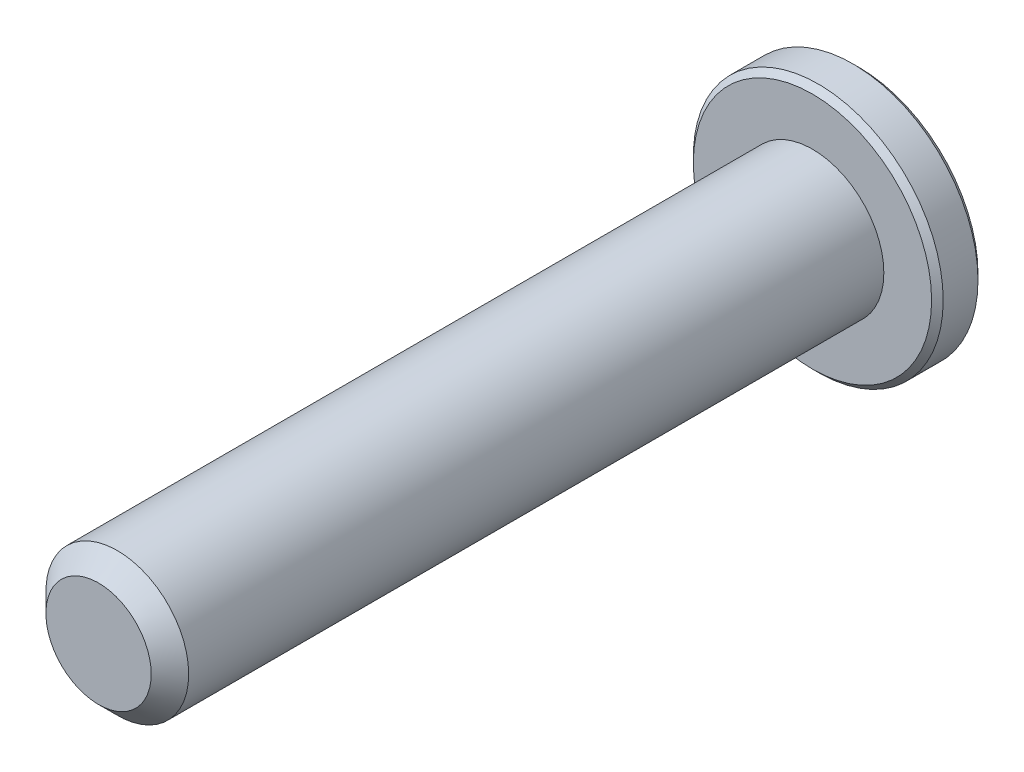
ISO-10303-21;
HEADER;
FILE_DESCRIPTION(('STEP AP214'),'2;1');
FILE_NAME('part.step','',(''),(''),'','','');
FILE_SCHEMA(('AUTOMOTIVE_DESIGN { 1 0 10303 214 1 1 1 1 }'));
ENDSEC;
DATA;
#1=APPLICATION_CONTEXT('core data for automotive mechanical design processes');
#2=APPLICATION_PROTOCOL_DEFINITION('international standard','automotive_design',2000,#1);
#3=PRODUCT_CONTEXT('',#1,'mechanical');
#4=PRODUCT('Part','Part','',(#3));
#5=PRODUCT_RELATED_PRODUCT_CATEGORY('part','',(#4));
#6=PRODUCT_DEFINITION_FORMATION('','',#4);
#7=PRODUCT_DEFINITION_CONTEXT('part definition',#1,'design');
#8=PRODUCT_DEFINITION('design','',#6,#7);
#9=PRODUCT_DEFINITION_SHAPE('','',#8);
#10=(LENGTH_UNIT() NAMED_UNIT(*) SI_UNIT(.MILLI.,.METRE.));
#11=(NAMED_UNIT(*) PLANE_ANGLE_UNIT() SI_UNIT($,.RADIAN.));
#12=(NAMED_UNIT(*) SI_UNIT($,.STERADIAN.) SOLID_ANGLE_UNIT());
#13=UNCERTAINTY_MEASURE_WITH_UNIT(LENGTH_MEASURE(1.E-05),#10,'distance_accuracy_value','');
#14=(GEOMETRIC_REPRESENTATION_CONTEXT(3) GLOBAL_UNCERTAINTY_ASSIGNED_CONTEXT((#13)) GLOBAL_UNIT_ASSIGNED_CONTEXT((#10,
#11,#12)) REPRESENTATION_CONTEXT('',''));
#15=CARTESIAN_POINT('',(0.,0.,0.));
#16=DIRECTION('',(0.,0.,1.));
#17=DIRECTION('',(1.,0.,0.));
#18=AXIS2_PLACEMENT_3D('',#15,#16,#17);
#19=CARTESIAN_POINT('',(0.,0.,-10.65));
#20=DIRECTION('',(0.,0.,1.));
#21=DIRECTION('',(1.,0.,0.));
#22=AXIS2_PLACEMENT_3D('',#19,#20,#21);
#23=PLANE('',#22);
#24=CARTESIAN_POINT('',(0.,0.,-10.65));
#25=DIRECTION('',(0.,0.,1.));
#26=DIRECTION('',(1.,0.,0.));
#27=AXIS2_PLACEMENT_3D('',#24,#25,#26);
#28=CIRCLE('',#27,3.3375);
#29=CARTESIAN_POINT('',(3.3375,0.,-10.65));
#30=VERTEX_POINT('',#29);
#31=EDGE_CURVE('E159',#30,#30,#28,.F.);
#32=ORIENTED_EDGE('',*,*,#31,.T.);
#33=EDGE_LOOP('',(#32));
#34=FACE_BOUND('',#33,.T.);
#35=CARTESIAN_POINT('',(0.,0.,-10.65));
#36=DIRECTION('',(0.,0.,1.));
#37=DIRECTION('',(1.,0.,0.));
#38=AXIS2_PLACEMENT_3D('',#35,#36,#37);
#39=CIRCLE('',#38,1.44337567297406);
#40=CARTESIAN_POINT('',(1.25,0.721687836487035,-10.65));
#41=VERTEX_POINT('',#40);
#42=CARTESIAN_POINT('',(0.,1.44337567297406,-10.65));
#43=VERTEX_POINT('',#42);
#44=EDGE_CURVE('E98',#41,#43,#39,.T.);
#45=ORIENTED_EDGE('',*,*,#44,.T.);
#46=CARTESIAN_POINT('',(0.,0.,-10.65));
#47=DIRECTION('',(0.,0.,1.));
#48=DIRECTION('',(1.,0.,0.));
#49=AXIS2_PLACEMENT_3D('',#46,#47,#48);
#50=CIRCLE('',#49,1.44337567297406);
#51=CARTESIAN_POINT('',(-1.25,0.721687836487029,-10.65));
#52=VERTEX_POINT('',#51);
#53=EDGE_CURVE('E110',#43,#52,#50,.T.);
#54=ORIENTED_EDGE('',*,*,#53,.T.);
#55=CARTESIAN_POINT('',(0.,0.,-10.65));
#56=DIRECTION('',(0.,0.,1.));
#57=DIRECTION('',(1.,0.,0.));
#58=AXIS2_PLACEMENT_3D('',#55,#56,#57);
#59=CIRCLE('',#58,1.44337567297406);
#60=CARTESIAN_POINT('',(-1.25,-0.721687836487029,-10.65));
#61=VERTEX_POINT('',#60);
#62=EDGE_CURVE('E131',#52,#61,#59,.T.);
#63=ORIENTED_EDGE('',*,*,#62,.T.);
#64=CARTESIAN_POINT('',(0.,0.,-10.65));
#65=DIRECTION('',(0.,0.,1.));
#66=DIRECTION('',(1.,0.,0.));
#67=AXIS2_PLACEMENT_3D('',#64,#65,#66);
#68=CIRCLE('',#67,1.44337567297406);
#69=CARTESIAN_POINT('',(0.,-1.44337567297406,-10.65));
#70=VERTEX_POINT('',#69);
#71=EDGE_CURVE('E416',#61,#70,#68,.T.);
#72=ORIENTED_EDGE('',*,*,#71,.T.);
#73=CARTESIAN_POINT('',(0.,0.,-10.65));
#74=DIRECTION('',(0.,0.,1.));
#75=DIRECTION('',(1.,0.,0.));
#76=AXIS2_PLACEMENT_3D('',#73,#74,#75);
#77=CIRCLE('',#76,1.44337567297406);
#78=CARTESIAN_POINT('',(1.25,-0.721687836487034,-10.65));
#79=VERTEX_POINT('',#78);
#80=EDGE_CURVE('E417',#70,#79,#77,.T.);
#81=ORIENTED_EDGE('',*,*,#80,.T.);
#82=CARTESIAN_POINT('',(0.,0.,-10.65));
#83=DIRECTION('',(0.,0.,1.));
#84=DIRECTION('',(1.,0.,0.));
#85=AXIS2_PLACEMENT_3D('',#82,#83,#84);
#86=CIRCLE('',#85,1.44337567297406);
#87=EDGE_CURVE('E113',#79,#41,#86,.T.);
#88=ORIENTED_EDGE('',*,*,#87,.T.);
#89=EDGE_LOOP('',(#45,#54,#63,#72,#81,#88));
#90=FACE_BOUND('',#89,.T.);
#91=ADVANCED_FACE('F39',(#34,#90),#23,.F.);
#92=CARTESIAN_POINT('',(1.25,0.721687836487033,-9.675));
#93=DIRECTION('',(-0.499999999999999,-0.866025403784439,0.));
#94=DIRECTION('',(0.866025403784439,-0.499999999999999,0.));
#95=AXIS2_PLACEMENT_3D('',#92,#93,#94);
#96=PLANE('',#95);
#97=DIRECTION('',(0.,0.,-1.));
#98=VECTOR('',#97,1.);
#99=CARTESIAN_POINT('',(0.,1.44337567297406,-9.675));
#100=LINE('',#99,#98);
#101=CARTESIAN_POINT('',(0.,1.44337567297406,-9.675));
#102=VERTEX_POINT('',#101);
#103=EDGE_CURVE('E127',#102,#43,#100,.T.);
#104=ORIENTED_EDGE('',*,*,#103,.T.);
#105=CARTESIAN_POINT('',(1.2502,0.721572366433196,-10.6501154839091));
#106=CARTESIAN_POINT('',(1.20722483292841,0.746384090710445,-10.6253216680551));
#107=CARTESIAN_POINT('',(1.16353099525405,0.771610739653666,-10.6019837344187));
#108=CARTESIAN_POINT('',(1.07443406915805,0.823050873919156,-10.5592520040845));
#109=CARTESIAN_POINT('',(1.02902250164293,0.849269254648334,-10.5398819923604));
#110=CARTESIAN_POINT('',(0.937452179064737,0.902137405038636,-10.5067004834135));
#111=CARTESIAN_POINT('',(0.891316759824111,0.928773701756388,-10.4928055590527));
#112=CARTESIAN_POINT('',(0.798029919592405,0.982632884076013,-10.4713972821606));
#113=CARTESIAN_POINT('',(0.750881350863618,1.00985412292348,-10.4638679415668));
#114=CARTESIAN_POINT('',(0.669626443112745,1.05676666578643,-10.4570744980507));
#115=CARTESIAN_POINT('',(0.635625123372057,1.07639733689152,-10.4560685591044));
#116=CARTESIAN_POINT('',(0.56768223556752,1.11562418145499,-10.4577614149113));
#117=CARTESIAN_POINT('',(0.53374068234434,1.1352203463451,-10.4604610272155));
#118=CARTESIAN_POINT('',(0.466185143542498,1.1742235548576,-10.4694089303164));
#119=CARTESIAN_POINT('',(0.432571492713223,1.19363040521232,-10.4756605258997));
#120=CARTESIAN_POINT('',(0.365905361782185,1.23212011385119,-10.4913756814139));
#121=CARTESIAN_POINT('',(0.332853128969702,1.2512028293628,-10.5008406200875));
#122=CARTESIAN_POINT('',(0.248200308399734,1.30007715810653,-10.5289313906876));
#123=CARTESIAN_POINT('',(0.19713350757036,1.32956058931202,-10.5496701574522));
#124=CARTESIAN_POINT('',(0.0969991458867438,1.38737318998519,-10.5963871346715));
#125=CARTESIAN_POINT('',(0.0479256884217294,1.41570576386268,-10.6223482959468));
#126=CARTESIAN_POINT('',(-0.000200000000001193,1.4434911430279,-10.6501154839091));
#127=B_SPLINE_CURVE_WITH_KNOTS('',3,(#105,#106,#107,#108,#109,#110,#111,#112,#113,#114,#115,
#116,#117,#118,#119,#120,#121,#122,#123,#124,#125,#126),.UNSPECIFIED.,.F.,.F.,(4,2,2,2,2,2,2,2,
2,2,4),(0.,0.166533409618304,0.334037607289762,0.498880396489697,0.663307919240273,
0.780963963458825,0.898645970148451,1.01643764860773,1.13427993171549,1.32148652032141,
1.50809158792573),.UNSPECIFIED.);
#128=EDGE_CURVE('E95',#41,#43,#127,.T.);
#129=ORIENTED_EDGE('',*,*,#128,.F.);
#130=DIRECTION('',(0.,0.,-1.));
#131=VECTOR('',#130,1.);
#132=CARTESIAN_POINT('',(1.25,0.721687836487033,-9.675));
#133=LINE('',#132,#131);
#134=CARTESIAN_POINT('',(1.25,0.721687836487033,-9.675));
#135=VERTEX_POINT('',#134);
#136=EDGE_CURVE('E394',#135,#41,#133,.T.);
#137=ORIENTED_EDGE('',*,*,#136,.F.);
#138=DIRECTION('',(-0.866025403784439,0.499999999999999,0.));
#139=VECTOR('',#138,1.);
#140=CARTESIAN_POINT('',(1.25,0.721687836487033,-9.675));
#141=LINE('',#140,#139);
#142=EDGE_CURVE('E122',#135,#102,#141,.T.);
#143=ORIENTED_EDGE('',*,*,#142,.T.);
#144=EDGE_LOOP('',(#104,#129,#137,#143));
#145=FACE_BOUND('',#144,.T.);
#146=ADVANCED_FACE('F134',(#145),#96,.T.);
#147=CARTESIAN_POINT('',(1.25,-0.721687836487029,-9.675));
#148=DIRECTION('',(-1.,0.,0.));
#149=DIRECTION('',(0.,-1.,0.));
#150=AXIS2_PLACEMENT_3D('',#147,#148,#149);
#151=PLANE('',#150);
#152=ORIENTED_EDGE('',*,*,#136,.T.);
#153=CARTESIAN_POINT('',(1.25,-1.38992943348888,-11.0759567827648));
#154=CARTESIAN_POINT('',(1.25,-1.35585360144598,-11.0506238459055));
#155=CARTESIAN_POINT('',(1.25,-1.32158265708561,-11.0255540386235));
#156=CARTESIAN_POINT('',(1.25,-1.25257320054391,-10.9760477721055));
#157=CARTESIAN_POINT('',(1.25,-1.21783456799035,-10.9516114808468));
#158=CARTESIAN_POINT('',(1.25,-1.11229379200971,-10.8790661726139));
#159=CARTESIAN_POINT('',(1.25,-1.04068485708168,-10.8321110392595));
#160=CARTESIAN_POINT('',(1.25,-0.890834011639571,-10.7403708166644));
#161=CARTESIAN_POINT('',(1.25,-0.812441254075324,-10.6958291712301));
#162=CARTESIAN_POINT('',(1.25,-0.651805951733885,-10.6146629588727));
#163=CARTESIAN_POINT('',(1.25,-0.56957751460335,-10.578011794068));
#164=CARTESIAN_POINT('',(1.25,-0.445666902783946,-10.5331887847256));
#165=CARTESIAN_POINT('',(1.25,-0.405715906756982,-10.5202456431435));
#166=CARTESIAN_POINT('',(1.25,-0.324892689132276,-10.4975737854096));
#167=CARTESIAN_POINT('',(1.25,-0.284020400151317,-10.4878453051979));
#168=CARTESIAN_POINT('',(1.25,-0.202258662465061,-10.4722576398138));
#169=CARTESIAN_POINT('',(1.25,-0.161381483064384,-10.4663350734316));
#170=CARTESIAN_POINT('',(1.25,-0.0792441307238307,-10.4584670213259));
#171=CARTESIAN_POINT('',(1.25,-0.0379840154943755,-10.4565209457961));
#172=CARTESIAN_POINT('',(1.25,0.0432341600364644,-10.456732896492));
#173=CARTESIAN_POINT('',(1.25,0.0831926097530761,-10.458764549044));
#174=CARTESIAN_POINT('',(1.25,0.16274644611995,-10.4665521810558));
#175=CARTESIAN_POINT('',(1.25,0.202341758544678,-10.4723089054431));
#176=CARTESIAN_POINT('',(1.25,0.281546319129819,-10.487338614174));
#177=CARTESIAN_POINT('',(1.25,0.321144394728611,-10.4966696274947));
#178=CARTESIAN_POINT('',(1.25,0.399480919290785,-10.5183670352383));
#179=CARTESIAN_POINT('',(1.25,0.438219456017127,-10.5307331181967));
#180=CARTESIAN_POINT('',(1.25,0.562551887219004,-10.5750110832811));
#181=CARTESIAN_POINT('',(1.25,0.646311872820087,-10.6120618108018));
#182=CARTESIAN_POINT('',(1.25,0.809873231963305,-10.6943641458391));
#183=CARTESIAN_POINT('',(1.25,0.889658742138619,-10.739645710239));
#184=CARTESIAN_POINT('',(1.25,1.04210036236046,-10.8329829301041));
#185=CARTESIAN_POINT('',(1.25,1.11491334005908,-10.8807855019631));
#186=CARTESIAN_POINT('',(1.25,1.22219009712169,-10.9546486700497));
#187=CARTESIAN_POINT('',(1.25,1.25748474843868,-10.9795235003093));
#188=CARTESIAN_POINT('',(1.25,1.32759376690004,-11.0299218847159));
#189=CARTESIAN_POINT('',(1.25,1.36240826213734,-11.0554452604736));
#190=CARTESIAN_POINT('',(1.25,1.3970231565127,-11.0812372736986));
#191=B_SPLINE_CURVE_WITH_KNOTS('',3,(#153,#154,#155,#156,#157,#158,#159,#160,#161,#162,#163,
#164,#165,#166,#167,#168,#169,#170,#171,#172,#173,#174,#175,#176,#177,#178,#179,#180,#181,#182,
#183,#184,#185,#186,#187,#188,#189,#190),.UNSPECIFIED.,.F.,.F.,(4,2,2,2,2,2,2,2,2,2,2,2,2,2,2,2,
2,2,4),(0.,0.127379033817001,0.254791503830237,0.511561140405461,0.781814668857773,
1.05114242314894,1.17702064742504,1.30290810848098,1.42664072359053,1.55035498493451,
1.67020252454504,1.7900740382739,1.91198034452075,2.03387414574236,2.30782771694623,
2.58279909340041,2.84397769429347,2.97351138093345,3.10300981562538),.UNSPECIFIED.);
#192=EDGE_CURVE('E103',#79,#41,#191,.T.);
#193=ORIENTED_EDGE('',*,*,#192,.F.);
#194=DIRECTION('',(0.,0.,-1.));
#195=VECTOR('',#194,1.);
#196=CARTESIAN_POINT('',(1.25,-0.721687836487029,-9.675));
#197=LINE('',#196,#195);
#198=CARTESIAN_POINT('',(1.25,-0.721687836487029,-9.675));
#199=VERTEX_POINT('',#198);
#200=EDGE_CURVE('E397',#199,#79,#197,.T.);
#201=ORIENTED_EDGE('',*,*,#200,.F.);
#202=DIRECTION('',(0.,1.,0.));
#203=VECTOR('',#202,1.);
#204=CARTESIAN_POINT('',(1.25,-0.721687836487029,-9.675));
#205=LINE('',#204,#203);
#206=EDGE_CURVE('E55',#199,#135,#205,.T.);
#207=ORIENTED_EDGE('',*,*,#206,.T.);
#208=EDGE_LOOP('',(#152,#193,#201,#207));
#209=FACE_BOUND('',#208,.T.);
#210=ADVANCED_FACE('F183',(#209),#151,.T.);
#211=CARTESIAN_POINT('',(0.,-1.44337567297406,-9.675));
#212=DIRECTION('',(-0.5,0.866025403784438,0.));
#213=DIRECTION('',(-0.866025403784439,-0.5,0.));
#214=AXIS2_PLACEMENT_3D('',#211,#212,#213);
#215=PLANE('',#214);
#216=ORIENTED_EDGE('',*,*,#200,.T.);
#217=CARTESIAN_POINT('',(-0.000199999999999487,-1.4434911430279,-10.6501154839091));
#218=CARTESIAN_POINT('',(0.0427751670715872,-1.41867941875065,-10.6253216680551));
#219=CARTESIAN_POINT('',(0.0864690047459486,-1.39345276980743,-10.6019837344187));
#220=CARTESIAN_POINT('',(0.175565930841943,-1.34201263554194,-10.5592520040845));
#221=CARTESIAN_POINT('',(0.220977498357065,-1.31579425481276,-10.5398819923604));
#222=CARTESIAN_POINT('',(0.312547820935261,-1.26292610442246,-10.5067004834135));
#223=CARTESIAN_POINT('',(0.358683240175886,-1.23628980770471,-10.4928055590527));
#224=CARTESIAN_POINT('',(0.451970080407593,-1.18243062538508,-10.4713972821606));
#225=CARTESIAN_POINT('',(0.49911864913638,-1.15520938653761,-10.4638679415668));
#226=CARTESIAN_POINT('',(0.580373556887253,-1.10829684367466,-10.4570744980507));
#227=CARTESIAN_POINT('',(0.614374876627941,-1.08866617256958,-10.4560685591043));
#228=CARTESIAN_POINT('',(0.682317764432478,-1.04943932800611,-10.4577614149113));
#229=CARTESIAN_POINT('',(0.716259317655657,-1.02984316311599,-10.4604610272155));
#230=CARTESIAN_POINT('',(0.783814856457499,-0.990839954603495,-10.4694089303164));
#231=CARTESIAN_POINT('',(0.817428507286775,-0.971433104248767,-10.4756605258997));
#232=CARTESIAN_POINT('',(0.884094638217813,-0.932943395609901,-10.4913756814139));
#233=CARTESIAN_POINT('',(0.917146871030295,-0.913860680098296,-10.5008406200875));
#234=CARTESIAN_POINT('',(1.00179969160026,-0.864986351354564,-10.5289313906876));
#235=CARTESIAN_POINT('',(1.05286649242964,-0.835502920149072,-10.5496701574522));
#236=CARTESIAN_POINT('',(1.15300085411325,-0.777690319475905,-10.5963871346715));
#237=CARTESIAN_POINT('',(1.20207431157827,-0.749357745598413,-10.6223482959468));
#238=CARTESIAN_POINT('',(1.2502,-0.721572366433191,-10.6501154839091));
#239=B_SPLINE_CURVE_WITH_KNOTS('',3,(#217,#218,#219,#220,#221,#222,#223,#224,#225,#226,#227,
#228,#229,#230,#231,#232,#233,#234,#235,#236,#237,#238),.UNSPECIFIED.,.F.,.F.,(4,2,2,2,2,2,2,2,
2,2,4),(0.,0.166533409618304,0.334037607289762,0.498880396489698,0.663307919240274,
0.780963963458826,0.898645970148452,1.01643764860773,1.13427993171549,1.32148652032141,
1.50809158792573),.UNSPECIFIED.);
#240=EDGE_CURVE('E425',#70,#79,#239,.T.);
#241=ORIENTED_EDGE('',*,*,#240,.F.);
#242=DIRECTION('',(0.,0.,-1.));
#243=VECTOR('',#242,1.);
#244=CARTESIAN_POINT('',(0.,-1.44337567297406,-9.675));
#245=LINE('',#244,#243);
#246=CARTESIAN_POINT('',(0.,-1.44337567297406,-9.675));
#247=VERTEX_POINT('',#246);
#248=EDGE_CURVE('E400',#247,#70,#245,.T.);
#249=ORIENTED_EDGE('',*,*,#248,.F.);
#250=DIRECTION('',(0.866025403784438,0.5,0.));
#251=VECTOR('',#250,1.);
#252=CARTESIAN_POINT('',(0.,-1.44337567297406,-9.675));
#253=LINE('',#252,#251);
#254=EDGE_CURVE('E63',#247,#199,#253,.T.);
#255=ORIENTED_EDGE('',*,*,#254,.T.);
#256=EDGE_LOOP('',(#216,#241,#249,#255));
#257=FACE_BOUND('',#256,.T.);
#258=ADVANCED_FACE('F301',(#257),#215,.T.);
#259=CARTESIAN_POINT('',(-1.25,-0.721687836487029,-9.675));
#260=DIRECTION('',(0.499999999999999,0.866025403784439,0.));
#261=DIRECTION('',(-0.866025403784439,0.499999999999999,0.));
#262=AXIS2_PLACEMENT_3D('',#259,#260,#261);
#263=PLANE('',#262);
#264=ORIENTED_EDGE('',*,*,#248,.T.);
#265=CARTESIAN_POINT('',(-1.2502,-0.721572366433191,-10.6501154839091));
#266=CARTESIAN_POINT('',(-1.20722483292841,-0.746384090710441,-10.6253216680551));
#267=CARTESIAN_POINT('',(-1.16353099525405,-0.771610739653661,-10.6019837344187));
#268=CARTESIAN_POINT('',(-1.07443406915806,-0.823050873919152,-10.5592520040845));
#269=CARTESIAN_POINT('',(-1.02902250164294,-0.84926925464833,-10.5398819923604));
#270=CARTESIAN_POINT('',(-0.93745217906474,-0.902137405038632,-10.5067004834135));
#271=CARTESIAN_POINT('',(-0.891316759824114,-0.928773701756384,-10.4928055590527));
#272=CARTESIAN_POINT('',(-0.798029919592407,-0.982632884076009,-10.4713972821606));
#273=CARTESIAN_POINT('',(-0.75088135086362,-1.00985412292348,-10.4638679415668));
#274=CARTESIAN_POINT('',(-0.669626443112748,-1.05676666578642,-10.4570744980507));
#275=CARTESIAN_POINT('',(-0.635625123372059,-1.07639733689151,-10.4560685591043));
#276=CARTESIAN_POINT('',(-0.567682235567523,-1.11562418145498,-10.4577614149113));
#277=CARTESIAN_POINT('',(-0.533740682344343,-1.1352203463451,-10.4604610272155));
#278=CARTESIAN_POINT('',(-0.466185143542501,-1.17422355485759,-10.4694089303164));
#279=CARTESIAN_POINT('',(-0.432571492713225,-1.19363040521232,-10.4756605258997));
#280=CARTESIAN_POINT('',(-0.365905361782187,-1.23212011385119,-10.4913756814139));
#281=CARTESIAN_POINT('',(-0.332853128969705,-1.25120282936279,-10.5008406200875));
#282=CARTESIAN_POINT('',(-0.248200308399736,-1.30007715810652,-10.5289313906876));
#283=CARTESIAN_POINT('',(-0.197133507570362,-1.32956058931202,-10.5496701574522));
#284=CARTESIAN_POINT('',(-0.0969991458867449,-1.38737318998518,-10.5963871346715));
#285=CARTESIAN_POINT('',(-0.0479256884217299,-1.41570576386268,-10.6223482959468));
#286=CARTESIAN_POINT('',(0.000200000000000766,-1.4434911430279,-10.6501154839091));
#287=B_SPLINE_CURVE_WITH_KNOTS('',3,(#265,#266,#267,#268,#269,#270,#271,#272,#273,#274,#275,
#276,#277,#278,#279,#280,#281,#282,#283,#284,#285,#286),.UNSPECIFIED.,.F.,.F.,(4,2,2,2,2,2,2,2,
2,2,4),(0.,0.166533409618304,0.334037607289762,0.498880396489698,0.663307919240274,
0.780963963458826,0.898645970148452,1.01643764860773,1.13427993171549,1.32148652032141,
1.50809158792574),.UNSPECIFIED.);
#288=EDGE_CURVE('E413',#61,#70,#287,.T.);
#289=ORIENTED_EDGE('',*,*,#288,.F.);
#290=DIRECTION('',(0.,0.,-1.));
#291=VECTOR('',#290,1.);
#292=CARTESIAN_POINT('',(-1.25,-0.721687836487029,-9.675));
#293=LINE('',#292,#291);
#294=CARTESIAN_POINT('',(-1.25,-0.721687836487029,-9.675));
#295=VERTEX_POINT('',#294);
#296=EDGE_CURVE('E144',#295,#61,#293,.T.);
#297=ORIENTED_EDGE('',*,*,#296,.F.);
#298=DIRECTION('',(0.866025403784439,-0.499999999999999,0.));
#299=VECTOR('',#298,1.);
#300=CARTESIAN_POINT('',(-1.25,-0.721687836487029,-9.675));
#301=LINE('',#300,#299);
#302=EDGE_CURVE('E387',#295,#247,#301,.T.);
#303=ORIENTED_EDGE('',*,*,#302,.T.);
#304=EDGE_LOOP('',(#264,#289,#297,#303));
#305=FACE_BOUND('',#304,.T.);
#306=ADVANCED_FACE('F309',(#305),#263,.T.);
#307=CARTESIAN_POINT('',(-1.25,0.721687836487031,-9.675));
#308=DIRECTION('',(1.,0.,0.));
#309=DIRECTION('',(0.,0.,-1.));
#310=AXIS2_PLACEMENT_3D('',#307,#308,#309);
#311=PLANE('',#310);
#312=ORIENTED_EDGE('',*,*,#296,.T.);
#313=CARTESIAN_POINT('',(-1.25,-1.38992943348888,-11.0759567827648));
#314=CARTESIAN_POINT('',(-1.25,-1.35585360144598,-11.0506238459055));
#315=CARTESIAN_POINT('',(-1.25,-1.32158265708561,-11.0255540386235));
#316=CARTESIAN_POINT('',(-1.25,-1.25257320054391,-10.9760477721055));
#317=CARTESIAN_POINT('',(-1.25,-1.21783456799035,-10.9516114808468));
#318=CARTESIAN_POINT('',(-1.25,-1.11229379200971,-10.8790661726139));
#319=CARTESIAN_POINT('',(-1.25,-1.04068485708168,-10.8321110392595));
#320=CARTESIAN_POINT('',(-1.25,-0.890834011639572,-10.7403708166644));
#321=CARTESIAN_POINT('',(-1.25,-0.812441254075325,-10.6958291712301));
#322=CARTESIAN_POINT('',(-1.25,-0.651805951733886,-10.6146629588727));
#323=CARTESIAN_POINT('',(-1.25,-0.56957751460335,-10.578011794068));
#324=CARTESIAN_POINT('',(-1.25,-0.445666902783946,-10.5331887847256));
#325=CARTESIAN_POINT('',(-1.25,-0.405715906756982,-10.5202456431435));
#326=CARTESIAN_POINT('',(-1.25,-0.324892689132276,-10.4975737854096));
#327=CARTESIAN_POINT('',(-1.25,-0.284020400151317,-10.4878453051979));
#328=CARTESIAN_POINT('',(-1.25,-0.20225866246506,-10.4722576398138));
#329=CARTESIAN_POINT('',(-1.25,-0.161381483064383,-10.4663350734316));
#330=CARTESIAN_POINT('',(-1.25,-0.0792441307238298,-10.4584670213259));
#331=CARTESIAN_POINT('',(-1.25,-0.0379840154943746,-10.4565209457961));
#332=CARTESIAN_POINT('',(-1.25,0.0432341600364653,-10.456732896492));
#333=CARTESIAN_POINT('',(-1.25,0.083192609753077,-10.458764549044));
#334=CARTESIAN_POINT('',(-1.25,0.16274644611995,-10.4665521810558));
#335=CARTESIAN_POINT('',(-1.25,0.202341758544679,-10.4723089054431));
#336=CARTESIAN_POINT('',(-1.25,0.28154631912982,-10.487338614174));
#337=CARTESIAN_POINT('',(-1.25,0.321144394728612,-10.4966696274947));
#338=CARTESIAN_POINT('',(-1.25,0.399480919290787,-10.5183670352383));
#339=CARTESIAN_POINT('',(-1.25,0.438219456017129,-10.5307331181967));
#340=CARTESIAN_POINT('',(-1.25,0.562551887219006,-10.5750110832811));
#341=CARTESIAN_POINT('',(-1.25,0.646311872820089,-10.6120618108018));
#342=CARTESIAN_POINT('',(-1.25,0.809873231963309,-10.6943641458391));
#343=CARTESIAN_POINT('',(-1.25,0.889658742138624,-10.739645710239));
#344=CARTESIAN_POINT('',(-1.25,1.04210036236046,-10.8329829301041));
#345=CARTESIAN_POINT('',(-1.25,1.11491334005909,-10.8807855019631));
#346=CARTESIAN_POINT('',(-1.25,1.22219009712169,-10.9546486700497));
#347=CARTESIAN_POINT('',(-1.25,1.25748474843869,-10.9795235003094));
#348=CARTESIAN_POINT('',(-1.25,1.32759376690005,-11.0299218847159));
#349=CARTESIAN_POINT('',(-1.25,1.36240826213735,-11.0554452604736));
#350=CARTESIAN_POINT('',(-1.25,1.39702315651271,-11.0812372736986));
#351=B_SPLINE_CURVE_WITH_KNOTS('',3,(#313,#314,#315,#316,#317,#318,#319,#320,#321,#322,#323,
#324,#325,#326,#327,#328,#329,#330,#331,#332,#333,#334,#335,#336,#337,#338,#339,#340,#341,#342,
#343,#344,#345,#346,#347,#348,#349,#350),.UNSPECIFIED.,.F.,.F.,(4,2,2,2,2,2,2,2,2,2,2,2,2,2,2,2,
2,2,4),(0.,0.127379033817002,0.254791503830238,0.511561140405459,0.781814668857771,
1.05114242314894,1.17702064742503,1.30290810848098,1.42664072359054,1.55035498493452,
1.67020252454504,1.7900740382739,1.91198034452075,2.03387414574236,2.30782771694623,
2.58279909340042,2.84397769429347,2.97351138093346,3.10300981562539),.UNSPECIFIED.);
#352=EDGE_CURVE('E408',#52,#61,#351,.F.);
#353=ORIENTED_EDGE('',*,*,#352,.F.);
#354=DIRECTION('',(0.,0.,-1.));
#355=VECTOR('',#354,1.);
#356=CARTESIAN_POINT('',(-1.25,0.721687836487031,-9.675));
#357=LINE('',#356,#355);
#358=CARTESIAN_POINT('',(-1.25,0.721687836487031,-9.675));
#359=VERTEX_POINT('',#358);
#360=EDGE_CURVE('E129',#359,#52,#357,.T.);
#361=ORIENTED_EDGE('',*,*,#360,.F.);
#362=DIRECTION('',(0.,-1.,0.));
#363=VECTOR('',#362,1.);
#364=CARTESIAN_POINT('',(-1.25,0.721687836487031,-9.675));
#365=LINE('',#364,#363);
#366=EDGE_CURVE('E384',#359,#295,#365,.T.);
#367=ORIENTED_EDGE('',*,*,#366,.T.);
#368=EDGE_LOOP('',(#312,#353,#361,#367));
#369=FACE_BOUND('',#368,.T.);
#370=ADVANCED_FACE('F317',(#369),#311,.T.);
#371=CARTESIAN_POINT('',(0.,1.44337567297406,-9.675));
#372=DIRECTION('',(0.5,-0.866025403784438,0.));
#373=DIRECTION('',(0.866025403784439,0.5,0.));
#374=AXIS2_PLACEMENT_3D('',#371,#372,#373);
#375=PLANE('',#374);
#376=ORIENTED_EDGE('',*,*,#360,.T.);
#377=CARTESIAN_POINT('',(0.000199999999997979,1.4434911430279,-10.6501154839091));
#378=CARTESIAN_POINT('',(-0.0427751670715884,1.41867941875065,-10.6253216680551));
#379=CARTESIAN_POINT('',(-0.0864690047459495,1.39345276980743,-10.6019837344187));
#380=CARTESIAN_POINT('',(-0.175565930841943,1.34201263554194,-10.5592520040845));
#381=CARTESIAN_POINT('',(-0.220977498357065,1.31579425481276,-10.5398819923604));
#382=CARTESIAN_POINT('',(-0.312547820935261,1.26292610442246,-10.5067004834135));
#383=CARTESIAN_POINT('',(-0.358683240175886,1.23628980770471,-10.4928055590527));
#384=CARTESIAN_POINT('',(-0.451970080407593,1.18243062538508,-10.4713972821606));
#385=CARTESIAN_POINT('',(-0.49911864913638,1.15520938653761,-10.4638679415668));
#386=CARTESIAN_POINT('',(-0.580373556887252,1.10829684367467,-10.4570744980507));
#387=CARTESIAN_POINT('',(-0.61437487662794,1.08866617256958,-10.4560685591044));
#388=CARTESIAN_POINT('',(-0.682317764432477,1.04943932800611,-10.4577614149113));
#389=CARTESIAN_POINT('',(-0.716259317655657,1.02984316311599,-10.4604610272155));
#390=CARTESIAN_POINT('',(-0.783814856457499,0.990839954603499,-10.4694089303164));
#391=CARTESIAN_POINT('',(-0.817428507286774,0.971433104248771,-10.4756605258997));
#392=CARTESIAN_POINT('',(-0.884094638217812,0.932943395609905,-10.4913756814139));
#393=CARTESIAN_POINT('',(-0.917146871030295,0.9138606800983,-10.5008406200875));
#394=CARTESIAN_POINT('',(-1.00179969160026,0.864986351354567,-10.5289313906876));
#395=CARTESIAN_POINT('',(-1.05286649242964,0.835502920149075,-10.5496701574522));
#396=CARTESIAN_POINT('',(-1.15300085411325,0.777690319475908,-10.5963871346715));
#397=CARTESIAN_POINT('',(-1.20207431157827,0.749357745598416,-10.6223482959468));
#398=CARTESIAN_POINT('',(-1.2502,0.721572366433194,-10.6501154839091));
#399=B_SPLINE_CURVE_WITH_KNOTS('',3,(#377,#378,#379,#380,#381,#382,#383,#384,#385,#386,#387,
#388,#389,#390,#391,#392,#393,#394,#395,#396,#397,#398),.UNSPECIFIED.,.F.,.F.,(4,2,2,2,2,2,2,2,
2,2,4),(0.,0.166533409618302,0.33403760728976,0.498880396489696,0.663307919240271,
0.780963963458823,0.898645970148449,1.01643764860773,1.13427993171549,1.3214865203214,
1.50809158792573),.UNSPECIFIED.);
#400=EDGE_CURVE('E120',#43,#52,#399,.T.);
#401=ORIENTED_EDGE('',*,*,#400,.F.);
#402=ORIENTED_EDGE('',*,*,#103,.F.);
#403=DIRECTION('',(-0.866025403784439,-0.5,0.));
#404=VECTOR('',#403,1.);
#405=CARTESIAN_POINT('',(0.,1.44337567297406,-9.675));
#406=LINE('',#405,#404);
#407=EDGE_CURVE('E381',#102,#359,#406,.T.);
#408=ORIENTED_EDGE('',*,*,#407,.T.);
#409=EDGE_LOOP('',(#376,#401,#402,#408));
#410=FACE_BOUND('',#409,.T.);
#411=ADVANCED_FACE('F126',(#410),#375,.T.);
#412=CARTESIAN_POINT('',(0.,0.,10.65));
#413=DIRECTION('',(0.,0.,-1.));
#414=DIRECTION('',(-1.,0.,0.));
#415=AXIS2_PLACEMENT_3D('',#412,#413,#414);
#416=CYLINDRICAL_SURFACE('',#415,2.);
#417=CARTESIAN_POINT('',(0.,0.,10.125));
#418=DIRECTION('',(0.,0.,1.));
#419=DIRECTION('',(1.,0.,0.));
#420=AXIS2_PLACEMENT_3D('',#417,#418,#419);
#421=CIRCLE('',#420,2.);
#422=CARTESIAN_POINT('',(2.,0.,10.125));
#423=VERTEX_POINT('',#422);
#424=EDGE_CURVE('E11',#423,#423,#421,.F.);
#425=ORIENTED_EDGE('',*,*,#424,.T.);
#426=EDGE_LOOP('',(#425));
#427=FACE_BOUND('',#426,.T.);
#428=CARTESIAN_POINT('',(0.,0.,-9.35));
#429=DIRECTION('',(0.,0.,1.));
#430=DIRECTION('',(1.,0.,0.));
#431=AXIS2_PLACEMENT_3D('',#428,#429,#430);
#432=CIRCLE('',#431,2.);
#433=CARTESIAN_POINT('',(2.,0.,-9.35));
#434=VERTEX_POINT('',#433);
#435=EDGE_CURVE('E137',#434,#434,#432,.T.);
#436=ORIENTED_EDGE('',*,*,#435,.T.);
#437=EDGE_LOOP('',(#436));
#438=FACE_BOUND('',#437,.T.);
#439=ADVANCED_FACE('F195',(#427,#438),#416,.T.);
#440=CARTESIAN_POINT('',(0.,0.,10.65));
#441=DIRECTION('',(0.,0.,1.));
#442=DIRECTION('',(1.,0.,0.));
#443=AXIS2_PLACEMENT_3D('',#440,#441,#442);
#444=PLANE('',#443);
#445=CARTESIAN_POINT('',(0.,0.,10.65));
#446=DIRECTION('',(0.,0.,1.));
#447=DIRECTION('',(1.,0.,0.));
#448=AXIS2_PLACEMENT_3D('',#445,#446,#447);
#449=CIRCLE('',#448,1.475);
#450=CARTESIAN_POINT('',(1.475,0.,10.65));
#451=VERTEX_POINT('',#450);
#452=EDGE_CURVE('E48',#451,#451,#449,.T.);
#453=ORIENTED_EDGE('',*,*,#452,.T.);
#454=EDGE_LOOP('',(#453));
#455=FACE_BOUND('',#454,.T.);
#456=ADVANCED_FACE('F166',(#455),#444,.T.);
#457=CARTESIAN_POINT('',(0.,0.,-9.35));
#458=DIRECTION('',(0.,0.,1.));
#459=DIRECTION('',(1.,0.,0.));
#460=AXIS2_PLACEMENT_3D('',#457,#458,#459);
#461=PLANE('',#460);
#462=CARTESIAN_POINT('',(0.,0.,-9.35));
#463=DIRECTION('',(0.,0.,1.));
#464=DIRECTION('',(1.,0.,0.));
#465=AXIS2_PLACEMENT_3D('',#462,#463,#464);
#466=CIRCLE('',#465,3.3375);
#467=CARTESIAN_POINT('',(3.3375,0.,-9.35));
#468=VERTEX_POINT('',#467);
#469=EDGE_CURVE('E142',#468,#468,#466,.T.);
#470=ORIENTED_EDGE('',*,*,#469,.T.);
#471=EDGE_LOOP('',(#470));
#472=FACE_BOUND('',#471,.T.);
#473=ORIENTED_EDGE('',*,*,#435,.F.);
#474=EDGE_LOOP('',(#473));
#475=FACE_BOUND('',#474,.T.);
#476=ADVANCED_FACE('F187',(#472,#475),#461,.T.);
#477=CARTESIAN_POINT('',(0.,0.,-9.35));
#478=DIRECTION('',(0.,0.,-1.));
#479=DIRECTION('',(-1.,0.,0.));
#480=AXIS2_PLACEMENT_3D('',#477,#478,#479);
#481=CYLINDRICAL_SURFACE('',#480,3.5);
#482=CARTESIAN_POINT('',(0.,0.,-9.5125));
#483=DIRECTION('',(0.,0.,1.));
#484=DIRECTION('',(1.,0.,0.));
#485=AXIS2_PLACEMENT_3D('',#482,#483,#484);
#486=CIRCLE('',#485,3.5);
#487=CARTESIAN_POINT('',(3.5,0.,-9.5125));
#488=VERTEX_POINT('',#487);
#489=EDGE_CURVE('E155',#488,#488,#486,.F.);
#490=ORIENTED_EDGE('',*,*,#489,.T.);
#491=EDGE_LOOP('',(#490));
#492=FACE_BOUND('',#491,.T.);
#493=CARTESIAN_POINT('',(0.,0.,-10.4875));
#494=DIRECTION('',(0.,0.,1.));
#495=DIRECTION('',(1.,0.,0.));
#496=AXIS2_PLACEMENT_3D('',#493,#494,#495);
#497=CIRCLE('',#496,3.5);
#498=CARTESIAN_POINT('',(3.5,0.,-10.4875));
#499=VERTEX_POINT('',#498);
#500=EDGE_CURVE('E151',#499,#499,#497,.T.);
#501=ORIENTED_EDGE('',*,*,#500,.T.);
#502=EDGE_LOOP('',(#501));
#503=FACE_BOUND('',#502,.T.);
#504=ADVANCED_FACE('F188',(#492,#503),#481,.T.);
#505=CARTESIAN_POINT('',(-1.25,2.16506350946109,-9.675));
#506=DIRECTION('',(0.,0.,1.));
#507=DIRECTION('',(1.,0.,0.));
#508=AXIS2_PLACEMENT_3D('',#505,#506,#507);
#509=PLANE('',#508);
#510=ORIENTED_EDGE('',*,*,#142,.F.);
#511=ORIENTED_EDGE('',*,*,#206,.F.);
#512=ORIENTED_EDGE('',*,*,#254,.F.);
#513=ORIENTED_EDGE('',*,*,#302,.F.);
#514=ORIENTED_EDGE('',*,*,#366,.F.);
#515=ORIENTED_EDGE('',*,*,#407,.F.);
#516=EDGE_LOOP('',(#510,#511,#512,#513,#514,#515));
#517=FACE_BOUND('',#516,.T.);
#518=ADVANCED_FACE('F191',(#517),#509,.F.);
#519=CARTESIAN_POINT('',(0.,0.,-10.65));
#520=DIRECTION('',(0.,0.,-1.));
#521=DIRECTION('',(1.,0.,0.));
#522=AXIS2_PLACEMENT_3D('',#519,#520,#521);
#523=CONICAL_SURFACE('',#522,1.44337567297406,0.78539816339745);
#524=ORIENTED_EDGE('',*,*,#400,.T.);
#525=ORIENTED_EDGE('',*,*,#53,.F.);
#526=EDGE_LOOP('',(#524,#525));
#527=FACE_BOUND('',#526,.T.);
#528=ADVANCED_FACE('F119',(#527),#523,.F.);
#529=CARTESIAN_POINT('',(0.,0.,-10.65));
#530=DIRECTION('',(0.,0.,-1.));
#531=DIRECTION('',(1.,0.,0.));
#532=AXIS2_PLACEMENT_3D('',#529,#530,#531);
#533=CONICAL_SURFACE('',#532,1.44337567297406,0.78539816339745);
#534=ORIENTED_EDGE('',*,*,#352,.T.);
#535=ORIENTED_EDGE('',*,*,#62,.F.);
#536=EDGE_LOOP('',(#534,#535));
#537=FACE_BOUND('',#536,.T.);
#538=ADVANCED_FACE('F236',(#537),#533,.F.);
#539=CARTESIAN_POINT('',(0.,0.,-10.65));
#540=DIRECTION('',(0.,0.,-1.));
#541=DIRECTION('',(1.,0.,0.));
#542=AXIS2_PLACEMENT_3D('',#539,#540,#541);
#543=CONICAL_SURFACE('',#542,1.44337567297406,0.78539816339745);
#544=ORIENTED_EDGE('',*,*,#288,.T.);
#545=ORIENTED_EDGE('',*,*,#71,.F.);
#546=EDGE_LOOP('',(#544,#545));
#547=FACE_BOUND('',#546,.T.);
#548=ADVANCED_FACE('F244',(#547),#543,.F.);
#549=CARTESIAN_POINT('',(0.,0.,-10.65));
#550=DIRECTION('',(0.,0.,-1.));
#551=DIRECTION('',(1.,0.,0.));
#552=AXIS2_PLACEMENT_3D('',#549,#550,#551);
#553=CONICAL_SURFACE('',#552,1.44337567297406,0.78539816339745);
#554=ORIENTED_EDGE('',*,*,#240,.T.);
#555=ORIENTED_EDGE('',*,*,#80,.F.);
#556=EDGE_LOOP('',(#554,#555));
#557=FACE_BOUND('',#556,.T.);
#558=ADVANCED_FACE('F252',(#557),#553,.F.);
#559=CARTESIAN_POINT('',(0.,0.,-10.65));
#560=DIRECTION('',(0.,0.,-1.));
#561=DIRECTION('',(1.,0.,0.));
#562=AXIS2_PLACEMENT_3D('',#559,#560,#561);
#563=CONICAL_SURFACE('',#562,1.44337567297406,0.78539816339745);
#564=ORIENTED_EDGE('',*,*,#192,.T.);
#565=ORIENTED_EDGE('',*,*,#87,.F.);
#566=EDGE_LOOP('',(#564,#565));
#567=FACE_BOUND('',#566,.T.);
#568=ADVANCED_FACE('F204',(#567),#563,.F.);
#569=CARTESIAN_POINT('',(0.,0.,-10.65));
#570=DIRECTION('',(0.,0.,-1.));
#571=DIRECTION('',(1.,0.,0.));
#572=AXIS2_PLACEMENT_3D('',#569,#570,#571);
#573=CONICAL_SURFACE('',#572,1.44337567297406,0.78539816339745);
#574=ORIENTED_EDGE('',*,*,#128,.T.);
#575=ORIENTED_EDGE('',*,*,#44,.F.);
#576=EDGE_LOOP('',(#574,#575));
#577=FACE_BOUND('',#576,.T.);
#578=ADVANCED_FACE('F97',(#577),#573,.F.);
#579=CARTESIAN_POINT('',(0.,0.,-9.35));
#580=DIRECTION('',(0.,0.,-1.));
#581=DIRECTION('',(-1.,0.,0.));
#582=AXIS2_PLACEMENT_3D('',#579,#580,#581);
#583=CONICAL_SURFACE('',#582,3.3375,0.785398163397451);
#584=ORIENTED_EDGE('',*,*,#489,.F.);
#585=EDGE_LOOP('',(#584));
#586=FACE_BOUND('',#585,.T.);
#587=ORIENTED_EDGE('',*,*,#469,.F.);
#588=EDGE_LOOP('',(#587));
#589=FACE_BOUND('',#588,.T.);
#590=ADVANCED_FACE('F174',(#586,#589),#583,.T.);
#591=CARTESIAN_POINT('',(0.,0.,-10.4875));
#592=DIRECTION('',(0.,0.,1.));
#593=DIRECTION('',(1.,0.,0.));
#594=AXIS2_PLACEMENT_3D('',#591,#592,#593);
#595=CONICAL_SURFACE('',#594,3.5,0.785398163397452);
#596=ORIENTED_EDGE('',*,*,#31,.F.);
#597=EDGE_LOOP('',(#596));
#598=FACE_BOUND('',#597,.T.);
#599=ORIENTED_EDGE('',*,*,#500,.F.);
#600=EDGE_LOOP('',(#599));
#601=FACE_BOUND('',#600,.T.);
#602=ADVANCED_FACE('F169',(#598,#601),#595,.T.);
#603=CARTESIAN_POINT('',(0.,0.,10.65));
#604=DIRECTION('',(0.,0.,-1.));
#605=DIRECTION('',(-1.,0.,0.));
#606=AXIS2_PLACEMENT_3D('',#603,#604,#605);
#607=CONICAL_SURFACE('',#606,1.475,0.785398163397448);
#608=ORIENTED_EDGE('',*,*,#424,.F.);
#609=EDGE_LOOP('',(#608));
#610=FACE_BOUND('',#609,.T.);
#611=ORIENTED_EDGE('',*,*,#452,.F.);
#612=EDGE_LOOP('',(#611));
#613=FACE_BOUND('',#612,.T.);
#614=ADVANCED_FACE('F41',(#610,#613),#607,.T.);
#615=CLOSED_SHELL('',(#91,#146,#210,#258,#306,#370,#411,#439,#456,#476,#504,#518,#528,#538,#548,
#558,#568,#578,#590,#602,#614));
#616=MANIFOLD_SOLID_BREP('B2',#615);
#617=ADVANCED_BREP_SHAPE_REPRESENTATION('',(#18,#616),#14);
#618=SHAPE_DEFINITION_REPRESENTATION(#9,#617);
ENDSEC;
END-ISO-10303-21;
